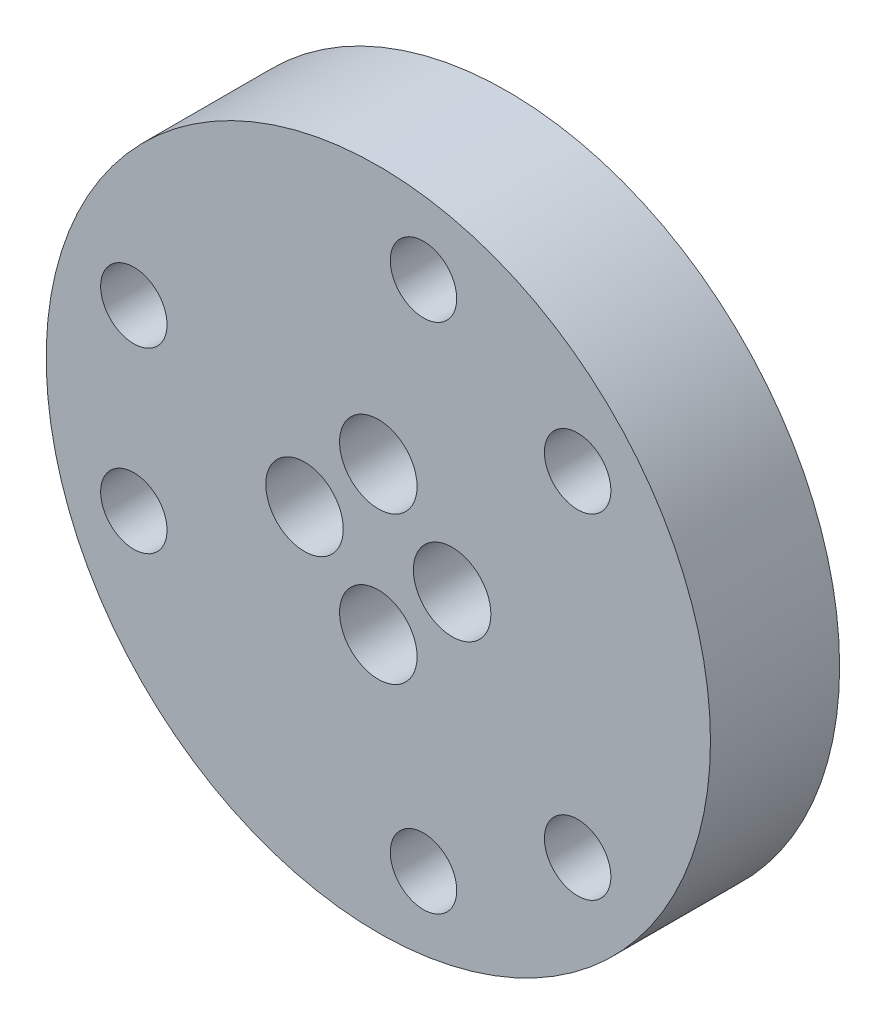
ISO-10303-21;
HEADER;
FILE_DESCRIPTION(('STEP AP214'),'2;1');
FILE_NAME('part.step','',(''),(''),'','','');
FILE_SCHEMA(('AUTOMOTIVE_DESIGN { 1 0 10303 214 1 1 1 1 }'));
ENDSEC;
DATA;
#1=APPLICATION_CONTEXT('core data for automotive mechanical design processes');
#2=APPLICATION_PROTOCOL_DEFINITION('international standard','automotive_design',2000,#1);
#3=PRODUCT_CONTEXT('',#1,'mechanical');
#4=PRODUCT('Part','Part','',(#3));
#5=PRODUCT_RELATED_PRODUCT_CATEGORY('part','',(#4));
#6=PRODUCT_DEFINITION_FORMATION('','',#4);
#7=PRODUCT_DEFINITION_CONTEXT('part definition',#1,'design');
#8=PRODUCT_DEFINITION('design','',#6,#7);
#9=PRODUCT_DEFINITION_SHAPE('','',#8);
#10=(LENGTH_UNIT() NAMED_UNIT(*) SI_UNIT(.MILLI.,.METRE.));
#11=(NAMED_UNIT(*) PLANE_ANGLE_UNIT() SI_UNIT($,.RADIAN.));
#12=(NAMED_UNIT(*) SI_UNIT($,.STERADIAN.) SOLID_ANGLE_UNIT());
#13=UNCERTAINTY_MEASURE_WITH_UNIT(LENGTH_MEASURE(1.E-05),#10,'distance_accuracy_value','');
#14=(GEOMETRIC_REPRESENTATION_CONTEXT(3) GLOBAL_UNCERTAINTY_ASSIGNED_CONTEXT((#13)) GLOBAL_UNIT_ASSIGNED_CONTEXT((#10,
#11,#12)) REPRESENTATION_CONTEXT('',''));
#15=CARTESIAN_POINT('',(0.,0.,0.));
#16=DIRECTION('',(0.,0.,1.));
#17=DIRECTION('',(1.,0.,0.));
#18=AXIS2_PLACEMENT_3D('',#15,#16,#17);
#19=CARTESIAN_POINT('',(0.,0.,0.));
#20=DIRECTION('',(0.,0.,1.));
#21=DIRECTION('',(1.,0.,0.));
#22=AXIS2_PLACEMENT_3D('',#19,#20,#21);
#23=PLANE('',#22);
#24=CARTESIAN_POINT('',(-13.2496659530813,4.82248402089194,0.));
#25=DIRECTION('',(0.,0.,-1.));
#26=DIRECTION('',(-1.,0.,0.));
#27=AXIS2_PLACEMENT_3D('',#24,#25,#26);
#28=CIRCLE('',#27,3.15);
#29=CARTESIAN_POINT('',(-16.3996659530813,4.82248402089194,0.));
#30=VERTEX_POINT('',#29);
#31=EDGE_CURVE('E205',#30,#30,#28,.T.);
#32=ORIENTED_EDGE('',*,*,#31,.F.);
#33=EDGE_LOOP('',(#32));
#34=FACE_BOUND('',#33,.T.);
#35=CARTESIAN_POINT('',(-4.,0.,0.));
#36=DIRECTION('',(0.,0.,1.));
#37=DIRECTION('',(1.,0.,0.));
#38=AXIS2_PLACEMENT_3D('',#35,#36,#37);
#39=CIRCLE('',#38,1.1);
#40=CARTESIAN_POINT('',(-2.9,0.,0.));
#41=VERTEX_POINT('',#40);
#42=EDGE_CURVE('E53',#41,#41,#39,.T.);
#43=ORIENTED_EDGE('',*,*,#42,.T.);
#44=EDGE_LOOP('',(#43));
#45=FACE_BOUND('',#44,.T.);
#46=CARTESIAN_POINT('',(0.,-4.,0.));
#47=DIRECTION('',(0.,0.,1.));
#48=DIRECTION('',(1.,0.,0.));
#49=AXIS2_PLACEMENT_3D('',#46,#47,#48);
#50=CIRCLE('',#49,1.1);
#51=CARTESIAN_POINT('',(1.1,-4.,0.));
#52=VERTEX_POINT('',#51);
#53=EDGE_CURVE('E76',#52,#52,#50,.T.);
#54=ORIENTED_EDGE('',*,*,#53,.T.);
#55=EDGE_LOOP('',(#54));
#56=FACE_BOUND('',#55,.T.);
#57=CARTESIAN_POINT('',(4.,0.,0.));
#58=DIRECTION('',(0.,0.,1.));
#59=DIRECTION('',(1.,0.,0.));
#60=AXIS2_PLACEMENT_3D('',#57,#58,#59);
#61=CIRCLE('',#60,1.1);
#62=CARTESIAN_POINT('',(5.1,0.,0.));
#63=VERTEX_POINT('',#62);
#64=EDGE_CURVE('E78',#63,#63,#61,.T.);
#65=ORIENTED_EDGE('',*,*,#64,.T.);
#66=EDGE_LOOP('',(#65));
#67=FACE_BOUND('',#66,.T.);
#68=CARTESIAN_POINT('',(0.,4.,0.));
#69=DIRECTION('',(0.,0.,1.));
#70=DIRECTION('',(1.,0.,0.));
#71=AXIS2_PLACEMENT_3D('',#68,#69,#70);
#72=CIRCLE('',#71,1.1);
#73=CARTESIAN_POINT('',(1.1,4.,0.));
#74=VERTEX_POINT('',#73);
#75=EDGE_CURVE('E45',#74,#74,#72,.T.);
#76=ORIENTED_EDGE('',*,*,#75,.T.);
#77=EDGE_LOOP('',(#76));
#78=FACE_BOUND('',#77,.T.);
#79=CARTESIAN_POINT('',(0.,0.,0.));
#80=DIRECTION('',(0.,0.,1.));
#81=DIRECTION('',(1.,0.,0.));
#82=AXIS2_PLACEMENT_3D('',#79,#80,#81);
#83=CIRCLE('',#82,18.);
#84=CARTESIAN_POINT('',(18.,0.,0.));
#85=VERTEX_POINT('',#84);
#86=EDGE_CURVE('E40',#85,#85,#83,.T.);
#87=ORIENTED_EDGE('',*,*,#86,.F.);
#88=EDGE_LOOP('',(#87));
#89=FACE_BOUND('',#88,.T.);
#90=CARTESIAN_POINT('',(10.8012266479773,9.06330529658191,0.));
#91=DIRECTION('',(0.,0.,-1.));
#92=DIRECTION('',(-1.,0.,0.));
#93=AXIS2_PLACEMENT_3D('',#90,#91,#92);
#94=CIRCLE('',#93,3.15);
#95=CARTESIAN_POINT('',(7.65122664797731,9.06330529658191,0.));
#96=VERTEX_POINT('',#95);
#97=EDGE_CURVE('E169',#96,#96,#94,.T.);
#98=ORIENTED_EDGE('',*,*,#97,.F.);
#99=EDGE_LOOP('',(#98));
#100=FACE_BOUND('',#99,.T.);
#101=CARTESIAN_POINT('',(10.8012266479789,-9.06330529657909,0.));
#102=DIRECTION('',(0.,0.,-1.));
#103=DIRECTION('',(-1.,0.,0.));
#104=AXIS2_PLACEMENT_3D('',#101,#102,#103);
#105=CIRCLE('',#104,3.15);
#106=CARTESIAN_POINT('',(7.65122664797894,-9.06330529657909,0.));
#107=VERTEX_POINT('',#106);
#108=EDGE_CURVE('E178',#107,#107,#105,.T.);
#109=ORIENTED_EDGE('',*,*,#108,.F.);
#110=EDGE_LOOP('',(#109));
#111=FACE_BOUND('',#110,.T.);
#112=CARTESIAN_POINT('',(2.44843930510505,-13.885789317471,0.));
#113=DIRECTION('',(0.,0.,-1.));
#114=DIRECTION('',(-1.,0.,0.));
#115=AXIS2_PLACEMENT_3D('',#112,#113,#114);
#116=CIRCLE('',#115,3.15);
#117=CARTESIAN_POINT('',(-0.701560694894948,-13.885789317471,0.));
#118=VERTEX_POINT('',#117);
#119=EDGE_CURVE('E187',#118,#118,#116,.T.);
#120=ORIENTED_EDGE('',*,*,#119,.F.);
#121=EDGE_LOOP('',(#120));
#122=FACE_BOUND('',#121,.T.);
#123=CARTESIAN_POINT('',(-13.2496659530813,-4.82248402089194,0.));
#124=DIRECTION('',(0.,0.,-1.));
#125=DIRECTION('',(-1.,0.,0.));
#126=AXIS2_PLACEMENT_3D('',#123,#124,#125);
#127=CIRCLE('',#126,3.15);
#128=CARTESIAN_POINT('',(-16.3996659530813,-4.82248402089194,0.));
#129=VERTEX_POINT('',#128);
#130=EDGE_CURVE('E196',#129,#129,#127,.T.);
#131=ORIENTED_EDGE('',*,*,#130,.F.);
#132=EDGE_LOOP('',(#131));
#133=FACE_BOUND('',#132,.T.);
#134=CARTESIAN_POINT('',(2.44843930510341,13.8857893174738,0.));
#135=DIRECTION('',(0.,0.,-1.));
#136=DIRECTION('',(-1.,0.,0.));
#137=AXIS2_PLACEMENT_3D('',#134,#135,#136);
#138=CIRCLE('',#137,3.15);
#139=CARTESIAN_POINT('',(-0.701560694896587,13.8857893174738,0.));
#140=VERTEX_POINT('',#139);
#141=EDGE_CURVE('E214',#140,#140,#138,.T.);
#142=ORIENTED_EDGE('',*,*,#141,.F.);
#143=EDGE_LOOP('',(#142));
#144=FACE_BOUND('',#143,.T.);
#145=ADVANCED_FACE('F32',(#34,#45,#56,#67,#78,#89,#100,#111,#122,#133,#144),#23,.F.);
#146=CARTESIAN_POINT('',(0.,0.,7.));
#147=DIRECTION('',(0.,0.,1.));
#148=DIRECTION('',(1.,0.,0.));
#149=AXIS2_PLACEMENT_3D('',#146,#147,#148);
#150=PLANE('',#149);
#151=CARTESIAN_POINT('',(2.44843930510341,13.8857893174738,7.00000000000001));
#152=DIRECTION('',(0.,0.,-1.));
#153=DIRECTION('',(-1.,0.,0.));
#154=AXIS2_PLACEMENT_3D('',#151,#152,#153);
#155=CIRCLE('',#154,1.79999999999999);
#156=CARTESIAN_POINT('',(0.648439305103426,13.8857893174738,7.00000000000001));
#157=VERTEX_POINT('',#156);
#158=EDGE_CURVE('E208',#157,#157,#155,.T.);
#159=ORIENTED_EDGE('',*,*,#158,.T.);
#160=EDGE_LOOP('',(#159));
#161=FACE_BOUND('',#160,.T.);
#162=CARTESIAN_POINT('',(0.,0.,7.));
#163=DIRECTION('',(0.,0.,1.));
#164=DIRECTION('',(1.,0.,0.));
#165=AXIS2_PLACEMENT_3D('',#162,#163,#164);
#166=CIRCLE('',#165,18.);
#167=CARTESIAN_POINT('',(18.,0.,7.));
#168=VERTEX_POINT('',#167);
#169=EDGE_CURVE('E10',#168,#168,#166,.T.);
#170=ORIENTED_EDGE('',*,*,#169,.T.);
#171=EDGE_LOOP('',(#170));
#172=FACE_BOUND('',#171,.T.);
#173=CARTESIAN_POINT('',(0.,4.,7.));
#174=DIRECTION('',(0.,0.,1.));
#175=DIRECTION('',(1.,0.,0.));
#176=AXIS2_PLACEMENT_3D('',#173,#174,#175);
#177=CIRCLE('',#176,2.1);
#178=CARTESIAN_POINT('',(2.1,4.,7.));
#179=VERTEX_POINT('',#178);
#180=EDGE_CURVE('E63',#179,#179,#177,.T.);
#181=ORIENTED_EDGE('',*,*,#180,.F.);
#182=EDGE_LOOP('',(#181));
#183=FACE_BOUND('',#182,.T.);
#184=CARTESIAN_POINT('',(0.,-4.,7.));
#185=DIRECTION('',(0.,0.,1.));
#186=DIRECTION('',(1.,0.,0.));
#187=AXIS2_PLACEMENT_3D('',#184,#185,#186);
#188=CIRCLE('',#187,2.1);
#189=CARTESIAN_POINT('',(2.1,-4.,7.));
#190=VERTEX_POINT('',#189);
#191=EDGE_CURVE('E156',#190,#190,#188,.T.);
#192=ORIENTED_EDGE('',*,*,#191,.F.);
#193=EDGE_LOOP('',(#192));
#194=FACE_BOUND('',#193,.T.);
#195=CARTESIAN_POINT('',(4.,0.,7.));
#196=DIRECTION('',(0.,0.,1.));
#197=DIRECTION('',(1.,0.,0.));
#198=AXIS2_PLACEMENT_3D('',#195,#196,#197);
#199=CIRCLE('',#198,2.1);
#200=CARTESIAN_POINT('',(6.1,0.,7.));
#201=VERTEX_POINT('',#200);
#202=EDGE_CURVE('E144',#201,#201,#199,.T.);
#203=ORIENTED_EDGE('',*,*,#202,.F.);
#204=EDGE_LOOP('',(#203));
#205=FACE_BOUND('',#204,.T.);
#206=CARTESIAN_POINT('',(-4.,0.,7.));
#207=DIRECTION('',(0.,0.,1.));
#208=DIRECTION('',(1.,0.,0.));
#209=AXIS2_PLACEMENT_3D('',#206,#207,#208);
#210=CIRCLE('',#209,2.1);
#211=CARTESIAN_POINT('',(-1.9,0.,7.));
#212=VERTEX_POINT('',#211);
#213=EDGE_CURVE('E145',#212,#212,#210,.T.);
#214=ORIENTED_EDGE('',*,*,#213,.F.);
#215=EDGE_LOOP('',(#214));
#216=FACE_BOUND('',#215,.T.);
#217=CARTESIAN_POINT('',(10.8012266479773,9.06330529658191,7.00000000000001));
#218=DIRECTION('',(0.,0.,-1.));
#219=DIRECTION('',(-1.,0.,0.));
#220=AXIS2_PLACEMENT_3D('',#217,#218,#219);
#221=CIRCLE('',#220,1.79999999999999);
#222=CARTESIAN_POINT('',(9.00122664797732,9.06330529658191,7.00000000000001));
#223=VERTEX_POINT('',#222);
#224=EDGE_CURVE('E151',#223,#223,#221,.T.);
#225=ORIENTED_EDGE('',*,*,#224,.T.);
#226=EDGE_LOOP('',(#225));
#227=FACE_BOUND('',#226,.T.);
#228=CARTESIAN_POINT('',(10.8012266479789,-9.06330529657909,7.00000000000001));
#229=DIRECTION('',(0.,0.,-1.));
#230=DIRECTION('',(-1.,0.,0.));
#231=AXIS2_PLACEMENT_3D('',#228,#229,#230);
#232=CIRCLE('',#231,1.79999999999999);
#233=CARTESIAN_POINT('',(9.00122664797895,-9.06330529657909,7.00000000000001));
#234=VERTEX_POINT('',#233);
#235=EDGE_CURVE('E172',#234,#234,#232,.T.);
#236=ORIENTED_EDGE('',*,*,#235,.T.);
#237=EDGE_LOOP('',(#236));
#238=FACE_BOUND('',#237,.T.);
#239=CARTESIAN_POINT('',(2.44843930510505,-13.885789317471,7.00000000000001));
#240=DIRECTION('',(0.,0.,-1.));
#241=DIRECTION('',(-1.,0.,0.));
#242=AXIS2_PLACEMENT_3D('',#239,#240,#241);
#243=CIRCLE('',#242,1.79999999999999);
#244=CARTESIAN_POINT('',(0.648439305105064,-13.885789317471,7.00000000000001));
#245=VERTEX_POINT('',#244);
#246=EDGE_CURVE('E181',#245,#245,#243,.T.);
#247=ORIENTED_EDGE('',*,*,#246,.T.);
#248=EDGE_LOOP('',(#247));
#249=FACE_BOUND('',#248,.T.);
#250=CARTESIAN_POINT('',(-13.2496659530813,-4.82248402089194,7.00000000000001));
#251=DIRECTION('',(0.,0.,-1.));
#252=DIRECTION('',(-1.,0.,0.));
#253=AXIS2_PLACEMENT_3D('',#250,#251,#252);
#254=CIRCLE('',#253,1.79999999999999);
#255=CARTESIAN_POINT('',(-15.0496659530813,-4.82248402089194,7.00000000000001));
#256=VERTEX_POINT('',#255);
#257=EDGE_CURVE('E190',#256,#256,#254,.T.);
#258=ORIENTED_EDGE('',*,*,#257,.T.);
#259=EDGE_LOOP('',(#258));
#260=FACE_BOUND('',#259,.T.);
#261=CARTESIAN_POINT('',(-13.2496659530813,4.82248402089194,7.00000000000001));
#262=DIRECTION('',(0.,0.,-1.));
#263=DIRECTION('',(-1.,0.,0.));
#264=AXIS2_PLACEMENT_3D('',#261,#262,#263);
#265=CIRCLE('',#264,1.79999999999999);
#266=CARTESIAN_POINT('',(-15.0496659530813,4.82248402089194,7.00000000000001));
#267=VERTEX_POINT('',#266);
#268=EDGE_CURVE('E199',#267,#267,#265,.T.);
#269=ORIENTED_EDGE('',*,*,#268,.T.);
#270=EDGE_LOOP('',(#269));
#271=FACE_BOUND('',#270,.T.);
#272=ADVANCED_FACE('F110',(#161,#172,#183,#194,#205,#216,#227,#238,#249,#260,#271),#150,.T.);
#273=CARTESIAN_POINT('',(4.,0.,7.));
#274=DIRECTION('',(0.,0.,-1.));
#275=DIRECTION('',(-1.,0.,0.));
#276=AXIS2_PLACEMENT_3D('',#273,#274,#275);
#277=CYLINDRICAL_SURFACE('',#276,1.1);
#278=ORIENTED_EDGE('',*,*,#64,.F.);
#279=EDGE_LOOP('',(#278));
#280=FACE_BOUND('',#279,.T.);
#281=CARTESIAN_POINT('',(4.,0.,1.4));
#282=DIRECTION('',(0.,0.,1.));
#283=DIRECTION('',(1.,0.,0.));
#284=AXIS2_PLACEMENT_3D('',#281,#282,#283);
#285=CIRCLE('',#284,1.1);
#286=CARTESIAN_POINT('',(5.1,0.,1.4));
#287=VERTEX_POINT('',#286);
#288=EDGE_CURVE('E36',#287,#287,#285,.T.);
#289=ORIENTED_EDGE('',*,*,#288,.T.);
#290=EDGE_LOOP('',(#289));
#291=FACE_BOUND('',#290,.T.);
#292=ADVANCED_FACE('F115',(#280,#291),#277,.F.);
#293=CARTESIAN_POINT('',(0.,-4.,7.));
#294=DIRECTION('',(0.,0.,-1.));
#295=DIRECTION('',(-1.,0.,0.));
#296=AXIS2_PLACEMENT_3D('',#293,#294,#295);
#297=CYLINDRICAL_SURFACE('',#296,1.1);
#298=ORIENTED_EDGE('',*,*,#53,.F.);
#299=EDGE_LOOP('',(#298));
#300=FACE_BOUND('',#299,.T.);
#301=CARTESIAN_POINT('',(0.,-4.,1.4));
#302=DIRECTION('',(0.,0.,1.));
#303=DIRECTION('',(1.,0.,0.));
#304=AXIS2_PLACEMENT_3D('',#301,#302,#303);
#305=CIRCLE('',#304,1.1);
#306=CARTESIAN_POINT('',(1.1,-4.,1.4));
#307=VERTEX_POINT('',#306);
#308=EDGE_CURVE('E57',#307,#307,#305,.T.);
#309=ORIENTED_EDGE('',*,*,#308,.T.);
#310=EDGE_LOOP('',(#309));
#311=FACE_BOUND('',#310,.T.);
#312=ADVANCED_FACE('F123',(#300,#311),#297,.F.);
#313=CARTESIAN_POINT('',(-4.,0.,7.));
#314=DIRECTION('',(0.,0.,-1.));
#315=DIRECTION('',(-1.,0.,0.));
#316=AXIS2_PLACEMENT_3D('',#313,#314,#315);
#317=CYLINDRICAL_SURFACE('',#316,1.1);
#318=ORIENTED_EDGE('',*,*,#42,.F.);
#319=EDGE_LOOP('',(#318));
#320=FACE_BOUND('',#319,.T.);
#321=CARTESIAN_POINT('',(-4.,0.,1.4));
#322=DIRECTION('',(0.,0.,1.));
#323=DIRECTION('',(1.,0.,0.));
#324=AXIS2_PLACEMENT_3D('',#321,#322,#323);
#325=CIRCLE('',#324,1.1);
#326=CARTESIAN_POINT('',(-2.9,0.,1.4));
#327=VERTEX_POINT('',#326);
#328=EDGE_CURVE('E55',#327,#327,#325,.T.);
#329=ORIENTED_EDGE('',*,*,#328,.T.);
#330=EDGE_LOOP('',(#329));
#331=FACE_BOUND('',#330,.T.);
#332=ADVANCED_FACE('F90',(#320,#331),#317,.F.);
#333=CARTESIAN_POINT('',(0.,4.,7.));
#334=DIRECTION('',(0.,0.,-1.));
#335=DIRECTION('',(-1.,0.,0.));
#336=AXIS2_PLACEMENT_3D('',#333,#334,#335);
#337=CYLINDRICAL_SURFACE('',#336,1.1);
#338=ORIENTED_EDGE('',*,*,#75,.F.);
#339=EDGE_LOOP('',(#338));
#340=FACE_BOUND('',#339,.T.);
#341=CARTESIAN_POINT('',(0.,4.,1.4));
#342=DIRECTION('',(0.,0.,1.));
#343=DIRECTION('',(1.,0.,0.));
#344=AXIS2_PLACEMENT_3D('',#341,#342,#343);
#345=CIRCLE('',#344,1.1);
#346=CARTESIAN_POINT('',(1.1,4.,1.4));
#347=VERTEX_POINT('',#346);
#348=EDGE_CURVE('E50',#347,#347,#345,.T.);
#349=ORIENTED_EDGE('',*,*,#348,.T.);
#350=EDGE_LOOP('',(#349));
#351=FACE_BOUND('',#350,.T.);
#352=ADVANCED_FACE('F87',(#340,#351),#337,.F.);
#353=CARTESIAN_POINT('',(0.,0.,7.));
#354=DIRECTION('',(0.,0.,-1.));
#355=DIRECTION('',(-1.,0.,0.));
#356=AXIS2_PLACEMENT_3D('',#353,#354,#355);
#357=CYLINDRICAL_SURFACE('',#356,18.);
#358=ORIENTED_EDGE('',*,*,#169,.F.);
#359=EDGE_LOOP('',(#358));
#360=FACE_BOUND('',#359,.T.);
#361=ORIENTED_EDGE('',*,*,#86,.T.);
#362=EDGE_LOOP('',(#361));
#363=FACE_BOUND('',#362,.T.);
#364=ADVANCED_FACE('F34',(#360,#363),#357,.T.);
#365=CARTESIAN_POINT('',(0.,4.,1.4));
#366=DIRECTION('',(0.,0.,1.));
#367=DIRECTION('',(1.,0.,0.));
#368=AXIS2_PLACEMENT_3D('',#365,#366,#367);
#369=CYLINDRICAL_SURFACE('',#368,2.1);
#370=CARTESIAN_POINT('',(0.,4.,1.4));
#371=DIRECTION('',(0.,0.,1.));
#372=DIRECTION('',(1.,0.,0.));
#373=AXIS2_PLACEMENT_3D('',#370,#371,#372);
#374=CIRCLE('',#373,2.1);
#375=CARTESIAN_POINT('',(2.1,4.,1.4));
#376=VERTEX_POINT('',#375);
#377=EDGE_CURVE('E54',#376,#376,#374,.T.);
#378=ORIENTED_EDGE('',*,*,#377,.F.);
#379=EDGE_LOOP('',(#378));
#380=FACE_BOUND('',#379,.T.);
#381=ORIENTED_EDGE('',*,*,#180,.T.);
#382=EDGE_LOOP('',(#381));
#383=FACE_BOUND('',#382,.T.);
#384=ADVANCED_FACE('F98',(#380,#383),#369,.F.);
#385=CARTESIAN_POINT('',(0.,4.,1.4));
#386=DIRECTION('',(0.,0.,1.));
#387=DIRECTION('',(1.,0.,0.));
#388=AXIS2_PLACEMENT_3D('',#385,#386,#387);
#389=PLANE('',#388);
#390=ORIENTED_EDGE('',*,*,#348,.F.);
#391=EDGE_LOOP('',(#390));
#392=FACE_BOUND('',#391,.T.);
#393=ORIENTED_EDGE('',*,*,#377,.T.);
#394=EDGE_LOOP('',(#393));
#395=FACE_BOUND('',#394,.T.);
#396=ADVANCED_FACE('F94',(#392,#395),#389,.T.);
#397=CARTESIAN_POINT('',(-4.,0.,1.4));
#398=DIRECTION('',(0.,0.,1.));
#399=DIRECTION('',(1.,0.,0.));
#400=AXIS2_PLACEMENT_3D('',#397,#398,#399);
#401=CYLINDRICAL_SURFACE('',#400,2.1);
#402=CARTESIAN_POINT('',(-4.,0.,1.4));
#403=DIRECTION('',(0.,0.,1.));
#404=DIRECTION('',(1.,0.,0.));
#405=AXIS2_PLACEMENT_3D('',#402,#403,#404);
#406=CIRCLE('',#405,2.1);
#407=CARTESIAN_POINT('',(-1.9,0.,1.4));
#408=VERTEX_POINT('',#407);
#409=EDGE_CURVE('E142',#408,#408,#406,.T.);
#410=ORIENTED_EDGE('',*,*,#409,.F.);
#411=EDGE_LOOP('',(#410));
#412=FACE_BOUND('',#411,.T.);
#413=ORIENTED_EDGE('',*,*,#213,.T.);
#414=EDGE_LOOP('',(#413));
#415=FACE_BOUND('',#414,.T.);
#416=ADVANCED_FACE('F97',(#412,#415),#401,.F.);
#417=CARTESIAN_POINT('',(-4.,0.,1.4));
#418=DIRECTION('',(0.,0.,1.));
#419=DIRECTION('',(1.,0.,0.));
#420=AXIS2_PLACEMENT_3D('',#417,#418,#419);
#421=PLANE('',#420);
#422=ORIENTED_EDGE('',*,*,#328,.F.);
#423=EDGE_LOOP('',(#422));
#424=FACE_BOUND('',#423,.T.);
#425=ORIENTED_EDGE('',*,*,#409,.T.);
#426=EDGE_LOOP('',(#425));
#427=FACE_BOUND('',#426,.T.);
#428=ADVANCED_FACE('F135',(#424,#427),#421,.T.);
#429=CARTESIAN_POINT('',(0.,-4.,1.4));
#430=DIRECTION('',(0.,0.,1.));
#431=DIRECTION('',(1.,0.,0.));
#432=AXIS2_PLACEMENT_3D('',#429,#430,#431);
#433=CYLINDRICAL_SURFACE('',#432,2.1);
#434=CARTESIAN_POINT('',(0.,-4.,1.4));
#435=DIRECTION('',(0.,0.,1.));
#436=DIRECTION('',(1.,0.,0.));
#437=AXIS2_PLACEMENT_3D('',#434,#435,#436);
#438=CIRCLE('',#437,2.1);
#439=CARTESIAN_POINT('',(2.1,-4.,1.4));
#440=VERTEX_POINT('',#439);
#441=EDGE_CURVE('E58',#440,#440,#438,.T.);
#442=ORIENTED_EDGE('',*,*,#441,.F.);
#443=EDGE_LOOP('',(#442));
#444=FACE_BOUND('',#443,.T.);
#445=ORIENTED_EDGE('',*,*,#191,.T.);
#446=EDGE_LOOP('',(#445));
#447=FACE_BOUND('',#446,.T.);
#448=ADVANCED_FACE('F138',(#444,#447),#433,.F.);
#449=CARTESIAN_POINT('',(0.,-4.,1.4));
#450=DIRECTION('',(0.,0.,1.));
#451=DIRECTION('',(1.,0.,0.));
#452=AXIS2_PLACEMENT_3D('',#449,#450,#451);
#453=PLANE('',#452);
#454=ORIENTED_EDGE('',*,*,#308,.F.);
#455=EDGE_LOOP('',(#454));
#456=FACE_BOUND('',#455,.T.);
#457=ORIENTED_EDGE('',*,*,#441,.T.);
#458=EDGE_LOOP('',(#457));
#459=FACE_BOUND('',#458,.T.);
#460=ADVANCED_FACE('F277',(#456,#459),#453,.T.);
#461=CARTESIAN_POINT('',(4.,0.,1.4));
#462=DIRECTION('',(0.,0.,1.));
#463=DIRECTION('',(1.,0.,0.));
#464=AXIS2_PLACEMENT_3D('',#461,#462,#463);
#465=CYLINDRICAL_SURFACE('',#464,2.1);
#466=CARTESIAN_POINT('',(4.,0.,1.4));
#467=DIRECTION('',(0.,0.,1.));
#468=DIRECTION('',(1.,0.,0.));
#469=AXIS2_PLACEMENT_3D('',#466,#467,#468);
#470=CIRCLE('',#469,2.1);
#471=CARTESIAN_POINT('',(6.1,0.,1.4));
#472=VERTEX_POINT('',#471);
#473=EDGE_CURVE('E148',#472,#472,#470,.T.);
#474=ORIENTED_EDGE('',*,*,#473,.F.);
#475=EDGE_LOOP('',(#474));
#476=FACE_BOUND('',#475,.T.);
#477=ORIENTED_EDGE('',*,*,#202,.T.);
#478=EDGE_LOOP('',(#477));
#479=FACE_BOUND('',#478,.T.);
#480=ADVANCED_FACE('F274',(#476,#479),#465,.F.);
#481=CARTESIAN_POINT('',(4.,0.,1.4));
#482=DIRECTION('',(0.,0.,1.));
#483=DIRECTION('',(1.,0.,0.));
#484=AXIS2_PLACEMENT_3D('',#481,#482,#483);
#485=PLANE('',#484);
#486=ORIENTED_EDGE('',*,*,#288,.F.);
#487=EDGE_LOOP('',(#486));
#488=FACE_BOUND('',#487,.T.);
#489=ORIENTED_EDGE('',*,*,#473,.T.);
#490=EDGE_LOOP('',(#489));
#491=FACE_BOUND('',#490,.T.);
#492=ADVANCED_FACE('F270',(#488,#491),#485,.T.);
#493=CARTESIAN_POINT('',(10.8012266479773,9.06330529658191,0.));
#494=DIRECTION('',(0.,0.,-1.));
#495=DIRECTION('',(-1.,0.,0.));
#496=AXIS2_PLACEMENT_3D('',#493,#494,#495);
#497=CYLINDRICAL_SURFACE('',#496,1.79999999999999);
#498=ORIENTED_EDGE('',*,*,#224,.F.);
#499=EDGE_LOOP('',(#498));
#500=FACE_BOUND('',#499,.T.);
#501=CARTESIAN_POINT('',(10.8012266479773,9.06330529658191,1.35));
#502=DIRECTION('',(0.,0.,-1.));
#503=DIRECTION('',(-1.,0.,0.));
#504=AXIS2_PLACEMENT_3D('',#501,#502,#503);
#505=CIRCLE('',#504,1.79999999999999);
#506=CARTESIAN_POINT('',(9.00122664797732,9.06330529658191,1.35));
#507=VERTEX_POINT('',#506);
#508=EDGE_CURVE('E166',#507,#507,#505,.T.);
#509=ORIENTED_EDGE('',*,*,#508,.T.);
#510=EDGE_LOOP('',(#509));
#511=FACE_BOUND('',#510,.T.);
#512=ADVANCED_FACE('F266',(#500,#511),#497,.F.);
#513=CARTESIAN_POINT('',(10.8012266479773,9.06330529658191,0.));
#514=DIRECTION('',(0.,0.,-1.));
#515=DIRECTION('',(-1.,0.,0.));
#516=AXIS2_PLACEMENT_3D('',#513,#514,#515);
#517=CONICAL_SURFACE('',#516,3.15,0.785398163397451);
#518=ORIENTED_EDGE('',*,*,#508,.F.);
#519=EDGE_LOOP('',(#518));
#520=FACE_BOUND('',#519,.T.);
#521=ORIENTED_EDGE('',*,*,#97,.T.);
#522=EDGE_LOOP('',(#521));
#523=FACE_BOUND('',#522,.T.);
#524=ADVANCED_FACE('F262',(#520,#523),#517,.F.);
#525=CARTESIAN_POINT('',(10.8012266479789,-9.06330529657909,0.));
#526=DIRECTION('',(0.,0.,-1.));
#527=DIRECTION('',(-1.,0.,0.));
#528=AXIS2_PLACEMENT_3D('',#525,#526,#527);
#529=CYLINDRICAL_SURFACE('',#528,1.79999999999999);
#530=ORIENTED_EDGE('',*,*,#235,.F.);
#531=EDGE_LOOP('',(#530));
#532=FACE_BOUND('',#531,.T.);
#533=CARTESIAN_POINT('',(10.8012266479789,-9.06330529657909,1.35));
#534=DIRECTION('',(0.,0.,-1.));
#535=DIRECTION('',(-1.,0.,0.));
#536=AXIS2_PLACEMENT_3D('',#533,#534,#535);
#537=CIRCLE('',#536,1.79999999999999);
#538=CARTESIAN_POINT('',(9.00122664797895,-9.06330529657909,1.35));
#539=VERTEX_POINT('',#538);
#540=EDGE_CURVE('E175',#539,#539,#537,.T.);
#541=ORIENTED_EDGE('',*,*,#540,.T.);
#542=EDGE_LOOP('',(#541));
#543=FACE_BOUND('',#542,.T.);
#544=ADVANCED_FACE('F258',(#532,#543),#529,.F.);
#545=CARTESIAN_POINT('',(10.8012266479789,-9.06330529657909,0.));
#546=DIRECTION('',(0.,0.,-1.));
#547=DIRECTION('',(-1.,0.,0.));
#548=AXIS2_PLACEMENT_3D('',#545,#546,#547);
#549=CONICAL_SURFACE('',#548,3.15,0.785398163397451);
#550=ORIENTED_EDGE('',*,*,#540,.F.);
#551=EDGE_LOOP('',(#550));
#552=FACE_BOUND('',#551,.T.);
#553=ORIENTED_EDGE('',*,*,#108,.T.);
#554=EDGE_LOOP('',(#553));
#555=FACE_BOUND('',#554,.T.);
#556=ADVANCED_FACE('F254',(#552,#555),#549,.F.);
#557=CARTESIAN_POINT('',(2.44843930510505,-13.885789317471,0.));
#558=DIRECTION('',(0.,0.,-1.));
#559=DIRECTION('',(-1.,0.,0.));
#560=AXIS2_PLACEMENT_3D('',#557,#558,#559);
#561=CYLINDRICAL_SURFACE('',#560,1.79999999999999);
#562=ORIENTED_EDGE('',*,*,#246,.F.);
#563=EDGE_LOOP('',(#562));
#564=FACE_BOUND('',#563,.T.);
#565=CARTESIAN_POINT('',(2.44843930510505,-13.885789317471,1.35));
#566=DIRECTION('',(0.,0.,-1.));
#567=DIRECTION('',(-1.,0.,0.));
#568=AXIS2_PLACEMENT_3D('',#565,#566,#567);
#569=CIRCLE('',#568,1.79999999999999);
#570=CARTESIAN_POINT('',(0.648439305105064,-13.885789317471,1.35));
#571=VERTEX_POINT('',#570);
#572=EDGE_CURVE('E184',#571,#571,#569,.T.);
#573=ORIENTED_EDGE('',*,*,#572,.T.);
#574=EDGE_LOOP('',(#573));
#575=FACE_BOUND('',#574,.T.);
#576=ADVANCED_FACE('F250',(#564,#575),#561,.F.);
#577=CARTESIAN_POINT('',(2.44843930510505,-13.885789317471,0.));
#578=DIRECTION('',(0.,0.,-1.));
#579=DIRECTION('',(-1.,0.,0.));
#580=AXIS2_PLACEMENT_3D('',#577,#578,#579);
#581=CONICAL_SURFACE('',#580,3.15,0.785398163397451);
#582=ORIENTED_EDGE('',*,*,#572,.F.);
#583=EDGE_LOOP('',(#582));
#584=FACE_BOUND('',#583,.T.);
#585=ORIENTED_EDGE('',*,*,#119,.T.);
#586=EDGE_LOOP('',(#585));
#587=FACE_BOUND('',#586,.T.);
#588=ADVANCED_FACE('F246',(#584,#587),#581,.F.);
#589=CARTESIAN_POINT('',(-13.2496659530813,-4.82248402089194,0.));
#590=DIRECTION('',(0.,0.,-1.));
#591=DIRECTION('',(-1.,0.,0.));
#592=AXIS2_PLACEMENT_3D('',#589,#590,#591);
#593=CYLINDRICAL_SURFACE('',#592,1.79999999999999);
#594=ORIENTED_EDGE('',*,*,#257,.F.);
#595=EDGE_LOOP('',(#594));
#596=FACE_BOUND('',#595,.T.);
#597=CARTESIAN_POINT('',(-13.2496659530813,-4.82248402089194,1.35));
#598=DIRECTION('',(0.,0.,-1.));
#599=DIRECTION('',(-1.,0.,0.));
#600=AXIS2_PLACEMENT_3D('',#597,#598,#599);
#601=CIRCLE('',#600,1.79999999999999);
#602=CARTESIAN_POINT('',(-15.0496659530813,-4.82248402089194,1.35));
#603=VERTEX_POINT('',#602);
#604=EDGE_CURVE('E193',#603,#603,#601,.T.);
#605=ORIENTED_EDGE('',*,*,#604,.T.);
#606=EDGE_LOOP('',(#605));
#607=FACE_BOUND('',#606,.T.);
#608=ADVANCED_FACE('F242',(#596,#607),#593,.F.);
#609=CARTESIAN_POINT('',(-13.2496659530813,-4.82248402089194,0.));
#610=DIRECTION('',(0.,0.,-1.));
#611=DIRECTION('',(-1.,0.,0.));
#612=AXIS2_PLACEMENT_3D('',#609,#610,#611);
#613=CONICAL_SURFACE('',#612,3.15,0.785398163397451);
#614=ORIENTED_EDGE('',*,*,#604,.F.);
#615=EDGE_LOOP('',(#614));
#616=FACE_BOUND('',#615,.T.);
#617=ORIENTED_EDGE('',*,*,#130,.T.);
#618=EDGE_LOOP('',(#617));
#619=FACE_BOUND('',#618,.T.);
#620=ADVANCED_FACE('F238',(#616,#619),#613,.F.);
#621=CARTESIAN_POINT('',(-13.2496659530813,4.82248402089194,0.));
#622=DIRECTION('',(0.,0.,-1.));
#623=DIRECTION('',(-1.,0.,0.));
#624=AXIS2_PLACEMENT_3D('',#621,#622,#623);
#625=CYLINDRICAL_SURFACE('',#624,1.79999999999999);
#626=ORIENTED_EDGE('',*,*,#268,.F.);
#627=EDGE_LOOP('',(#626));
#628=FACE_BOUND('',#627,.T.);
#629=CARTESIAN_POINT('',(-13.2496659530813,4.82248402089194,1.35));
#630=DIRECTION('',(0.,0.,-1.));
#631=DIRECTION('',(-1.,0.,0.));
#632=AXIS2_PLACEMENT_3D('',#629,#630,#631);
#633=CIRCLE('',#632,1.79999999999999);
#634=CARTESIAN_POINT('',(-15.0496659530813,4.82248402089194,1.35));
#635=VERTEX_POINT('',#634);
#636=EDGE_CURVE('E202',#635,#635,#633,.T.);
#637=ORIENTED_EDGE('',*,*,#636,.T.);
#638=EDGE_LOOP('',(#637));
#639=FACE_BOUND('',#638,.T.);
#640=ADVANCED_FACE('F234',(#628,#639),#625,.F.);
#641=CARTESIAN_POINT('',(-13.2496659530813,4.82248402089194,0.));
#642=DIRECTION('',(0.,0.,-1.));
#643=DIRECTION('',(-1.,0.,0.));
#644=AXIS2_PLACEMENT_3D('',#641,#642,#643);
#645=CONICAL_SURFACE('',#644,3.15,0.785398163397451);
#646=ORIENTED_EDGE('',*,*,#636,.F.);
#647=EDGE_LOOP('',(#646));
#648=FACE_BOUND('',#647,.T.);
#649=ORIENTED_EDGE('',*,*,#31,.T.);
#650=EDGE_LOOP('',(#649));
#651=FACE_BOUND('',#650,.T.);
#652=ADVANCED_FACE('F227',(#648,#651),#645,.F.);
#653=CARTESIAN_POINT('',(2.44843930510341,13.8857893174738,0.));
#654=DIRECTION('',(0.,0.,-1.));
#655=DIRECTION('',(-1.,0.,0.));
#656=AXIS2_PLACEMENT_3D('',#653,#654,#655);
#657=CYLINDRICAL_SURFACE('',#656,1.79999999999999);
#658=ORIENTED_EDGE('',*,*,#158,.F.);
#659=EDGE_LOOP('',(#658));
#660=FACE_BOUND('',#659,.T.);
#661=CARTESIAN_POINT('',(2.44843930510341,13.8857893174738,1.35));
#662=DIRECTION('',(0.,0.,-1.));
#663=DIRECTION('',(-1.,0.,0.));
#664=AXIS2_PLACEMENT_3D('',#661,#662,#663);
#665=CIRCLE('',#664,1.79999999999999);
#666=CARTESIAN_POINT('',(0.648439305103426,13.8857893174738,1.35));
#667=VERTEX_POINT('',#666);
#668=EDGE_CURVE('E211',#667,#667,#665,.T.);
#669=ORIENTED_EDGE('',*,*,#668,.T.);
#670=EDGE_LOOP('',(#669));
#671=FACE_BOUND('',#670,.T.);
#672=ADVANCED_FACE('F221',(#660,#671),#657,.F.);
#673=CARTESIAN_POINT('',(2.44843930510341,13.8857893174738,0.));
#674=DIRECTION('',(0.,0.,-1.));
#675=DIRECTION('',(-1.,0.,0.));
#676=AXIS2_PLACEMENT_3D('',#673,#674,#675);
#677=CONICAL_SURFACE('',#676,3.15,0.785398163397451);
#678=ORIENTED_EDGE('',*,*,#668,.F.);
#679=EDGE_LOOP('',(#678));
#680=FACE_BOUND('',#679,.T.);
#681=ORIENTED_EDGE('',*,*,#141,.T.);
#682=EDGE_LOOP('',(#681));
#683=FACE_BOUND('',#682,.T.);
#684=ADVANCED_FACE('F218',(#680,#683),#677,.F.);
#685=CLOSED_SHELL('',(#145,#272,#292,#312,#332,#352,#364,#384,#396,#416,#428,#448,#460,#480,
#492,#512,#524,#544,#556,#576,#588,#608,#620,#640,#652,#672,#684));
#686=MANIFOLD_SOLID_BREP('B2',#685);
#687=ADVANCED_BREP_SHAPE_REPRESENTATION('',(#18,#686),#14);
#688=SHAPE_DEFINITION_REPRESENTATION(#9,#687);
ENDSEC;
END-ISO-10303-21;
